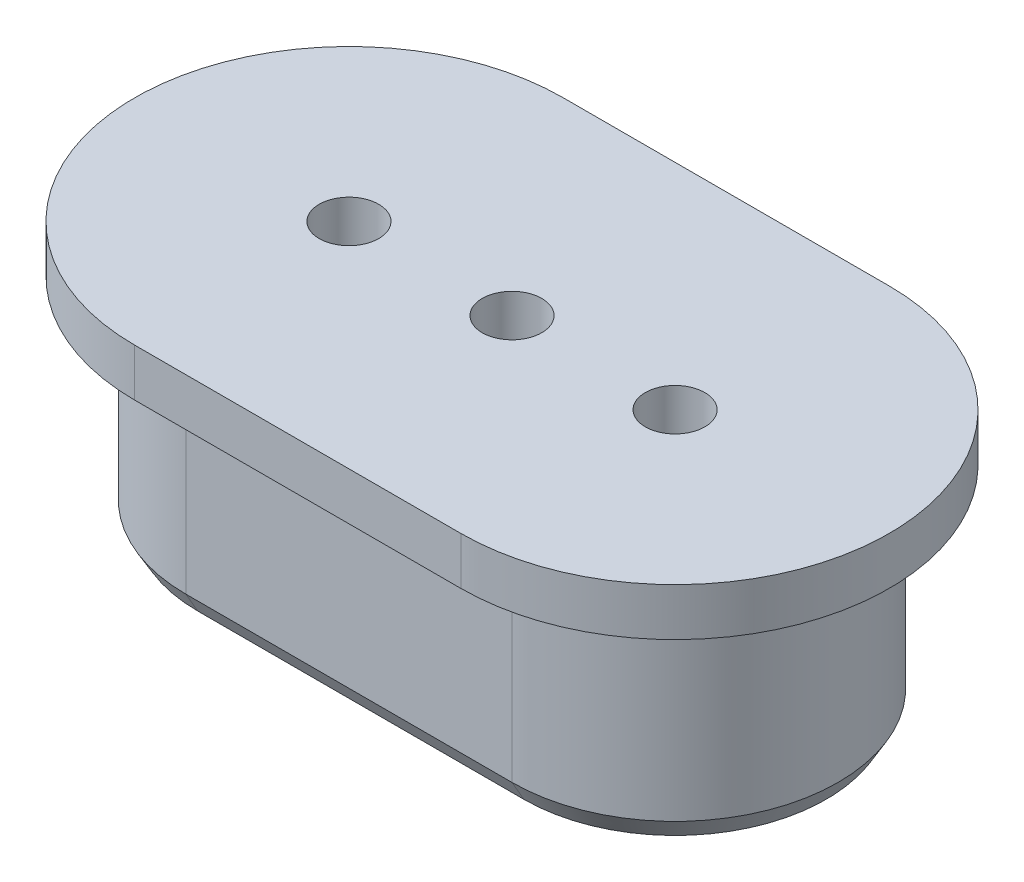
ISO-10303-21;
HEADER;
FILE_DESCRIPTION(('STEP AP214'),'2;1');
FILE_NAME('part.step','',(''),(''),'','','');
FILE_SCHEMA(('AUTOMOTIVE_DESIGN { 1 0 10303 214 1 1 1 1 }'));
ENDSEC;
DATA;
#1=APPLICATION_CONTEXT('core data for automotive mechanical design processes');
#2=APPLICATION_PROTOCOL_DEFINITION('international standard','automotive_design',2000,#1);
#3=PRODUCT_CONTEXT('',#1,'mechanical');
#4=PRODUCT('Part','Part','',(#3));
#5=PRODUCT_RELATED_PRODUCT_CATEGORY('part','',(#4));
#6=PRODUCT_DEFINITION_FORMATION('','',#4);
#7=PRODUCT_DEFINITION_CONTEXT('part definition',#1,'design');
#8=PRODUCT_DEFINITION('design','',#6,#7);
#9=PRODUCT_DEFINITION_SHAPE('','',#8);
#10=(LENGTH_UNIT() NAMED_UNIT(*) SI_UNIT(.MILLI.,.METRE.));
#11=(NAMED_UNIT(*) PLANE_ANGLE_UNIT() SI_UNIT($,.RADIAN.));
#12=(NAMED_UNIT(*) SI_UNIT($,.STERADIAN.) SOLID_ANGLE_UNIT());
#13=UNCERTAINTY_MEASURE_WITH_UNIT(LENGTH_MEASURE(1.E-05),#10,'distance_accuracy_value','');
#14=(GEOMETRIC_REPRESENTATION_CONTEXT(3) GLOBAL_UNCERTAINTY_ASSIGNED_CONTEXT((#13)) GLOBAL_UNIT_ASSIGNED_CONTEXT((#10,
#11,#12)) REPRESENTATION_CONTEXT('',''));
#15=CARTESIAN_POINT('',(0.,0.,0.));
#16=DIRECTION('',(0.,0.,1.));
#17=DIRECTION('',(1.,0.,0.));
#18=AXIS2_PLACEMENT_3D('',#15,#16,#17);
#19=CARTESIAN_POINT('',(3.425,0.,0.));
#20=DIRECTION('',(0.,-1.,0.));
#21=DIRECTION('',(0.,0.,-1.));
#22=AXIS2_PLACEMENT_3D('',#19,#20,#21);
#23=PLANE('',#22);
#24=DIRECTION('',(-1.,0.,0.));
#25=VECTOR('',#24,1.);
#26=CARTESIAN_POINT('',(-3.425,0.,3.175));
#27=LINE('',#26,#25);
#28=CARTESIAN_POINT('',(3.425,0.,3.175));
#29=VERTEX_POINT('',#28);
#30=CARTESIAN_POINT('',(-3.425,0.,3.175));
#31=VERTEX_POINT('',#30);
#32=EDGE_CURVE('E235',#29,#31,#27,.T.);
#33=ORIENTED_EDGE('',*,*,#32,.T.);
#34=CARTESIAN_POINT('',(-3.425,0.,0.));
#35=DIRECTION('',(0.,-1.,0.));
#36=DIRECTION('',(0.,0.,-1.));
#37=AXIS2_PLACEMENT_3D('',#34,#35,#36);
#38=CIRCLE('',#37,3.175);
#39=CARTESIAN_POINT('',(-3.425,0.,-3.175));
#40=VERTEX_POINT('',#39);
#41=EDGE_CURVE('E237',#31,#40,#38,.T.);
#42=ORIENTED_EDGE('',*,*,#41,.T.);
#43=DIRECTION('',(1.,0.,0.));
#44=VECTOR('',#43,1.);
#45=CARTESIAN_POINT('',(3.425,0.,-3.175));
#46=LINE('',#45,#44);
#47=CARTESIAN_POINT('',(3.425,0.,-3.175));
#48=VERTEX_POINT('',#47);
#49=EDGE_CURVE('E231',#40,#48,#46,.T.);
#50=ORIENTED_EDGE('',*,*,#49,.T.);
#51=CARTESIAN_POINT('',(3.425,0.,0.));
#52=DIRECTION('',(0.,-1.,0.));
#53=DIRECTION('',(0.,0.,-1.));
#54=AXIS2_PLACEMENT_3D('',#51,#52,#53);
#55=CIRCLE('',#54,3.175);
#56=EDGE_CURVE('E233',#48,#29,#55,.T.);
#57=ORIENTED_EDGE('',*,*,#56,.T.);
#58=EDGE_LOOP('',(#33,#42,#50,#57));
#59=FACE_BOUND('',#58,.T.);
#60=DIRECTION('',(1.,0.,0.));
#61=VECTOR('',#60,1.);
#62=CARTESIAN_POINT('',(-3.425,0.,2.925));
#63=LINE('',#62,#61);
#64=CARTESIAN_POINT('',(-3.425,0.,2.925));
#65=VERTEX_POINT('',#64);
#66=CARTESIAN_POINT('',(3.425,0.,2.925));
#67=VERTEX_POINT('',#66);
#68=EDGE_CURVE('E181',#65,#67,#63,.T.);
#69=ORIENTED_EDGE('',*,*,#68,.T.);
#70=CARTESIAN_POINT('',(3.425,0.,0.));
#71=DIRECTION('',(0.,1.,0.));
#72=DIRECTION('',(0.,0.,-1.));
#73=AXIS2_PLACEMENT_3D('',#70,#71,#72);
#74=CIRCLE('',#73,2.925);
#75=CARTESIAN_POINT('',(3.425,0.,-2.925));
#76=VERTEX_POINT('',#75);
#77=EDGE_CURVE('E168',#67,#76,#74,.T.);
#78=ORIENTED_EDGE('',*,*,#77,.T.);
#79=DIRECTION('',(-1.,0.,0.));
#80=VECTOR('',#79,1.);
#81=CARTESIAN_POINT('',(-3.425,0.,-2.925));
#82=LINE('',#81,#80);
#83=CARTESIAN_POINT('',(-3.425,0.,-2.925));
#84=VERTEX_POINT('',#83);
#85=EDGE_CURVE('E171',#76,#84,#82,.T.);
#86=ORIENTED_EDGE('',*,*,#85,.T.);
#87=CARTESIAN_POINT('',(-3.425,0.,0.));
#88=DIRECTION('',(0.,1.,0.));
#89=DIRECTION('',(0.,0.,1.));
#90=AXIS2_PLACEMENT_3D('',#87,#88,#89);
#91=CIRCLE('',#90,2.925);
#92=EDGE_CURVE('E193',#84,#65,#91,.T.);
#93=ORIENTED_EDGE('',*,*,#92,.T.);
#94=EDGE_LOOP('',(#69,#78,#86,#93));
#95=FACE_BOUND('',#94,.T.);
#96=ADVANCED_FACE('F37',(#59,#95),#23,.T.);
#97=CARTESIAN_POINT('',(3.425,4.5,0.));
#98=DIRECTION('',(0.,-1.,0.));
#99=DIRECTION('',(0.,0.,-1.));
#100=AXIS2_PLACEMENT_3D('',#97,#98,#99);
#101=CYLINDRICAL_SURFACE('',#100,3.425);
#102=DIRECTION('',(0.,-1.,0.));
#103=VECTOR('',#102,1.);
#104=CARTESIAN_POINT('',(3.425,4.5,3.425));
#105=LINE('',#104,#103);
#106=CARTESIAN_POINT('',(3.425,4.5,3.425));
#107=VERTEX_POINT('',#106);
#108=CARTESIAN_POINT('',(3.425,0.433012701892218,3.425));
#109=VERTEX_POINT('',#108);
#110=EDGE_CURVE('E219',#107,#109,#105,.T.);
#111=ORIENTED_EDGE('',*,*,#110,.T.);
#112=CARTESIAN_POINT('',(3.425,0.433012701892218,0.));
#113=DIRECTION('',(0.,-1.,0.));
#114=DIRECTION('',(0.,0.,-1.));
#115=AXIS2_PLACEMENT_3D('',#112,#113,#114);
#116=CIRCLE('',#115,3.425);
#117=CARTESIAN_POINT('',(3.425,0.433012701892218,-3.425));
#118=VERTEX_POINT('',#117);
#119=EDGE_CURVE('E47',#109,#118,#116,.F.);
#120=ORIENTED_EDGE('',*,*,#119,.T.);
#121=DIRECTION('',(0.,-1.,0.));
#122=VECTOR('',#121,1.);
#123=CARTESIAN_POINT('',(3.425,4.5,-3.425));
#124=LINE('',#123,#122);
#125=CARTESIAN_POINT('',(3.425,4.5,-3.425));
#126=VERTEX_POINT('',#125);
#127=EDGE_CURVE('E226',#126,#118,#124,.T.);
#128=ORIENTED_EDGE('',*,*,#127,.F.);
#129=CARTESIAN_POINT('',(3.425,4.5,0.));
#130=DIRECTION('',(0.,1.,0.));
#131=DIRECTION('',(0.,0.,-1.));
#132=AXIS2_PLACEMENT_3D('',#129,#130,#131);
#133=CIRCLE('',#132,3.425);
#134=EDGE_CURVE('E207',#107,#126,#133,.T.);
#135=ORIENTED_EDGE('',*,*,#134,.F.);
#136=EDGE_LOOP('',(#111,#120,#128,#135));
#137=FACE_BOUND('',#136,.T.);
#138=ADVANCED_FACE('F301',(#137),#101,.T.);
#139=CARTESIAN_POINT('',(-3.425,4.5,-3.425));
#140=DIRECTION('',(0.,0.,1.));
#141=DIRECTION('',(1.,0.,0.));
#142=AXIS2_PLACEMENT_3D('',#139,#140,#141);
#143=PLANE('',#142);
#144=ORIENTED_EDGE('',*,*,#127,.T.);
#145=DIRECTION('',(-1.,0.,0.));
#146=VECTOR('',#145,1.);
#147=CARTESIAN_POINT('',(-3.425,0.433012701892218,-3.425));
#148=LINE('',#147,#146);
#149=CARTESIAN_POINT('',(-3.425,0.433012701892218,-3.425));
#150=VERTEX_POINT('',#149);
#151=EDGE_CURVE('E11',#118,#150,#148,.T.);
#152=ORIENTED_EDGE('',*,*,#151,.T.);
#153=DIRECTION('',(0.,-1.,0.));
#154=VECTOR('',#153,1.);
#155=CARTESIAN_POINT('',(-3.425,4.5,-3.425));
#156=LINE('',#155,#154);
#157=CARTESIAN_POINT('',(-3.425,4.5,-3.425));
#158=VERTEX_POINT('',#157);
#159=EDGE_CURVE('E223',#158,#150,#156,.T.);
#160=ORIENTED_EDGE('',*,*,#159,.F.);
#161=DIRECTION('',(-1.,0.,0.));
#162=VECTOR('',#161,1.);
#163=CARTESIAN_POINT('',(-3.425,4.5,-3.425));
#164=LINE('',#163,#162);
#165=EDGE_CURVE('E210',#126,#158,#164,.T.);
#166=ORIENTED_EDGE('',*,*,#165,.F.);
#167=EDGE_LOOP('',(#144,#152,#160,#166));
#168=FACE_BOUND('',#167,.T.);
#169=ADVANCED_FACE('F307',(#168),#143,.F.);
#170=CARTESIAN_POINT('',(-3.425,4.5,0.));
#171=DIRECTION('',(0.,-1.,0.));
#172=DIRECTION('',(0.,0.,-1.));
#173=AXIS2_PLACEMENT_3D('',#170,#171,#172);
#174=CYLINDRICAL_SURFACE('',#173,3.425);
#175=ORIENTED_EDGE('',*,*,#159,.T.);
#176=CARTESIAN_POINT('',(-3.425,0.433012701892218,0.));
#177=DIRECTION('',(0.,-1.,0.));
#178=DIRECTION('',(0.,0.,-1.));
#179=AXIS2_PLACEMENT_3D('',#176,#177,#178);
#180=CIRCLE('',#179,3.425);
#181=CARTESIAN_POINT('',(-3.425,0.433012701892218,3.425));
#182=VERTEX_POINT('',#181);
#183=EDGE_CURVE('E228',#150,#182,#180,.F.);
#184=ORIENTED_EDGE('',*,*,#183,.T.);
#185=DIRECTION('',(0.,-1.,0.));
#186=VECTOR('',#185,1.);
#187=CARTESIAN_POINT('',(-3.425,4.5,3.425));
#188=LINE('',#187,#186);
#189=CARTESIAN_POINT('',(-3.425,4.5,3.425));
#190=VERTEX_POINT('',#189);
#191=EDGE_CURVE('E221',#190,#182,#188,.T.);
#192=ORIENTED_EDGE('',*,*,#191,.F.);
#193=CARTESIAN_POINT('',(-3.425,4.5,0.));
#194=DIRECTION('',(0.,1.,0.));
#195=DIRECTION('',(0.,0.,1.));
#196=AXIS2_PLACEMENT_3D('',#193,#194,#195);
#197=CIRCLE('',#196,3.425);
#198=EDGE_CURVE('E213',#158,#190,#197,.T.);
#199=ORIENTED_EDGE('',*,*,#198,.F.);
#200=EDGE_LOOP('',(#175,#184,#192,#199));
#201=FACE_BOUND('',#200,.T.);
#202=ADVANCED_FACE('F317',(#201),#174,.T.);
#203=CARTESIAN_POINT('',(-3.425,4.5,3.425));
#204=DIRECTION('',(0.,0.,-1.));
#205=DIRECTION('',(-1.,0.,0.));
#206=AXIS2_PLACEMENT_3D('',#203,#204,#205);
#207=PLANE('',#206);
#208=ORIENTED_EDGE('',*,*,#191,.T.);
#209=DIRECTION('',(1.,0.,0.));
#210=VECTOR('',#209,1.);
#211=CARTESIAN_POINT('',(3.425,0.433012701892218,3.425));
#212=LINE('',#211,#210);
#213=EDGE_CURVE('E62',#182,#109,#212,.T.);
#214=ORIENTED_EDGE('',*,*,#213,.T.);
#215=ORIENTED_EDGE('',*,*,#110,.F.);
#216=DIRECTION('',(1.,0.,0.));
#217=VECTOR('',#216,1.);
#218=CARTESIAN_POINT('',(-3.425,4.5,3.425));
#219=LINE('',#218,#217);
#220=EDGE_CURVE('E216',#190,#107,#219,.T.);
#221=ORIENTED_EDGE('',*,*,#220,.F.);
#222=EDGE_LOOP('',(#208,#214,#215,#221));
#223=FACE_BOUND('',#222,.T.);
#224=ADVANCED_FACE('F314',(#223),#207,.F.);
#225=CARTESIAN_POINT('',(3.425,4.5,0.));
#226=DIRECTION('',(0.,-1.,0.));
#227=DIRECTION('',(0.,0.,-1.));
#228=AXIS2_PLACEMENT_3D('',#225,#226,#227);
#229=CYLINDRICAL_SURFACE('',#228,2.925);
#230=ORIENTED_EDGE('',*,*,#77,.F.);
#231=DIRECTION('',(0.,-1.,0.));
#232=VECTOR('',#231,1.);
#233=CARTESIAN_POINT('',(3.425,4.5,2.925));
#234=LINE('',#233,#232);
#235=CARTESIAN_POINT('',(3.425,4.5,2.925));
#236=VERTEX_POINT('',#235);
#237=EDGE_CURVE('E189',#236,#67,#234,.T.);
#238=ORIENTED_EDGE('',*,*,#237,.F.);
#239=CARTESIAN_POINT('',(3.425,4.5,0.));
#240=DIRECTION('',(0.,1.,0.));
#241=DIRECTION('',(0.,0.,-1.));
#242=AXIS2_PLACEMENT_3D('',#239,#240,#241);
#243=CIRCLE('',#242,2.925);
#244=CARTESIAN_POINT('',(3.425,4.5,-2.925));
#245=VERTEX_POINT('',#244);
#246=EDGE_CURVE('E177',#236,#245,#243,.T.);
#247=ORIENTED_EDGE('',*,*,#246,.T.);
#248=DIRECTION('',(0.,-1.,0.));
#249=VECTOR('',#248,1.);
#250=CARTESIAN_POINT('',(3.425,4.5,-2.925));
#251=LINE('',#250,#249);
#252=EDGE_CURVE('E204',#245,#76,#251,.T.);
#253=ORIENTED_EDGE('',*,*,#252,.T.);
#254=EDGE_LOOP('',(#230,#238,#247,#253));
#255=FACE_BOUND('',#254,.T.);
#256=ADVANCED_FACE('F312',(#255),#229,.F.);
#257=CARTESIAN_POINT('',(-3.425,4.5,-2.925));
#258=DIRECTION('',(0.,0.,1.));
#259=DIRECTION('',(1.,0.,0.));
#260=AXIS2_PLACEMENT_3D('',#257,#258,#259);
#261=PLANE('',#260);
#262=ORIENTED_EDGE('',*,*,#85,.F.);
#263=ORIENTED_EDGE('',*,*,#252,.F.);
#264=DIRECTION('',(-1.,0.,0.));
#265=VECTOR('',#264,1.);
#266=CARTESIAN_POINT('',(-3.425,4.5,-2.925));
#267=LINE('',#266,#265);
#268=CARTESIAN_POINT('',(-3.425,4.5,-2.925));
#269=VERTEX_POINT('',#268);
#270=EDGE_CURVE('E180',#245,#269,#267,.T.);
#271=ORIENTED_EDGE('',*,*,#270,.T.);
#272=DIRECTION('',(0.,-1.,0.));
#273=VECTOR('',#272,1.);
#274=CARTESIAN_POINT('',(-3.425,4.5,-2.925));
#275=LINE('',#274,#273);
#276=EDGE_CURVE('E202',#269,#84,#275,.T.);
#277=ORIENTED_EDGE('',*,*,#276,.T.);
#278=EDGE_LOOP('',(#262,#263,#271,#277));
#279=FACE_BOUND('',#278,.T.);
#280=ADVANCED_FACE('F502',(#279),#261,.T.);
#281=CARTESIAN_POINT('',(-3.425,4.5,0.));
#282=DIRECTION('',(0.,-1.,0.));
#283=DIRECTION('',(0.,0.,-1.));
#284=AXIS2_PLACEMENT_3D('',#281,#282,#283);
#285=CYLINDRICAL_SURFACE('',#284,2.925);
#286=ORIENTED_EDGE('',*,*,#92,.F.);
#287=ORIENTED_EDGE('',*,*,#276,.F.);
#288=CARTESIAN_POINT('',(-3.425,4.5,0.));
#289=DIRECTION('',(0.,1.,0.));
#290=DIRECTION('',(0.,0.,1.));
#291=AXIS2_PLACEMENT_3D('',#288,#289,#290);
#292=CIRCLE('',#291,2.925);
#293=CARTESIAN_POINT('',(-3.425,4.5,2.925));
#294=VERTEX_POINT('',#293);
#295=EDGE_CURVE('E184',#269,#294,#292,.T.);
#296=ORIENTED_EDGE('',*,*,#295,.T.);
#297=DIRECTION('',(0.,-1.,0.));
#298=VECTOR('',#297,1.);
#299=CARTESIAN_POINT('',(-3.425,4.5,2.925));
#300=LINE('',#299,#298);
#301=EDGE_CURVE('E200',#294,#65,#300,.T.);
#302=ORIENTED_EDGE('',*,*,#301,.T.);
#303=EDGE_LOOP('',(#286,#287,#296,#302));
#304=FACE_BOUND('',#303,.T.);
#305=ADVANCED_FACE('F372',(#304),#285,.F.);
#306=CARTESIAN_POINT('',(-3.425,4.5,2.925));
#307=DIRECTION('',(0.,0.,-1.));
#308=DIRECTION('',(-1.,0.,0.));
#309=AXIS2_PLACEMENT_3D('',#306,#307,#308);
#310=PLANE('',#309);
#311=ORIENTED_EDGE('',*,*,#68,.F.);
#312=ORIENTED_EDGE('',*,*,#301,.F.);
#313=DIRECTION('',(1.,0.,0.));
#314=VECTOR('',#313,1.);
#315=CARTESIAN_POINT('',(-3.425,4.5,2.925));
#316=LINE('',#315,#314);
#317=EDGE_CURVE('E187',#294,#236,#316,.T.);
#318=ORIENTED_EDGE('',*,*,#317,.T.);
#319=ORIENTED_EDGE('',*,*,#237,.T.);
#320=EDGE_LOOP('',(#311,#312,#318,#319));
#321=FACE_BOUND('',#320,.T.);
#322=ADVANCED_FACE('F363',(#321),#310,.T.);
#323=CARTESIAN_POINT('',(-3.425,4.5,0.));
#324=DIRECTION('',(0.,1.,0.));
#325=DIRECTION('',(0.,0.,1.));
#326=AXIS2_PLACEMENT_3D('',#323,#324,#325);
#327=PLANE('',#326);
#328=CARTESIAN_POINT('',(-3.425,4.5,0.));
#329=DIRECTION('',(0.,1.,0.));
#330=DIRECTION('',(0.,0.,1.));
#331=AXIS2_PLACEMENT_3D('',#328,#329,#330);
#332=CIRCLE('',#331,4.5);
#333=CARTESIAN_POINT('',(-3.425,4.5,-4.5));
#334=VERTEX_POINT('',#333);
#335=CARTESIAN_POINT('',(-3.425,4.5,4.5));
#336=VERTEX_POINT('',#335);
#337=EDGE_CURVE('E167',#334,#336,#332,.T.);
#338=ORIENTED_EDGE('',*,*,#337,.F.);
#339=DIRECTION('',(-1.,0.,0.));
#340=VECTOR('',#339,1.);
#341=CARTESIAN_POINT('',(-3.425,4.5,-4.5));
#342=LINE('',#341,#340);
#343=CARTESIAN_POINT('',(3.425,4.5,-4.5));
#344=VERTEX_POINT('',#343);
#345=EDGE_CURVE('E163',#344,#334,#342,.T.);
#346=ORIENTED_EDGE('',*,*,#345,.F.);
#347=CARTESIAN_POINT('',(3.425,4.5,0.));
#348=DIRECTION('',(0.,1.,0.));
#349=DIRECTION('',(0.,0.,-1.));
#350=AXIS2_PLACEMENT_3D('',#347,#348,#349);
#351=CIRCLE('',#350,4.5);
#352=CARTESIAN_POINT('',(3.425,4.5,4.5));
#353=VERTEX_POINT('',#352);
#354=EDGE_CURVE('E277',#353,#344,#351,.T.);
#355=ORIENTED_EDGE('',*,*,#354,.F.);
#356=DIRECTION('',(1.,0.,0.));
#357=VECTOR('',#356,1.);
#358=CARTESIAN_POINT('',(-3.425,4.5,4.5));
#359=LINE('',#358,#357);
#360=EDGE_CURVE('E275',#336,#353,#359,.T.);
#361=ORIENTED_EDGE('',*,*,#360,.F.);
#362=EDGE_LOOP('',(#338,#346,#355,#361));
#363=FACE_BOUND('',#362,.T.);
#364=ORIENTED_EDGE('',*,*,#220,.T.);
#365=ORIENTED_EDGE('',*,*,#134,.T.);
#366=ORIENTED_EDGE('',*,*,#165,.T.);
#367=ORIENTED_EDGE('',*,*,#198,.T.);
#368=EDGE_LOOP('',(#364,#365,#366,#367));
#369=FACE_BOUND('',#368,.T.);
#370=ADVANCED_FACE('F288',(#363,#369),#327,.F.);
#371=CARTESIAN_POINT('',(-3.425,5.5,0.));
#372=DIRECTION('',(0.,1.,0.));
#373=DIRECTION('',(0.,0.,1.));
#374=AXIS2_PLACEMENT_3D('',#371,#372,#373);
#375=PLANE('',#374);
#376=CARTESIAN_POINT('',(0.,5.5,0.));
#377=DIRECTION('',(0.,1.,0.));
#378=DIRECTION('',(0.,0.,1.));
#379=AXIS2_PLACEMENT_3D('',#376,#377,#378);
#380=CIRCLE('',#379,0.625);
#381=CARTESIAN_POINT('',(0.,5.5,0.625));
#382=VERTEX_POINT('',#381);
#383=EDGE_CURVE('E245',#382,#382,#380,.T.);
#384=ORIENTED_EDGE('',*,*,#383,.F.);
#385=EDGE_LOOP('',(#384));
#386=FACE_BOUND('',#385,.T.);
#387=CARTESIAN_POINT('',(-3.425,5.5,0.));
#388=DIRECTION('',(0.,1.,0.));
#389=DIRECTION('',(0.,0.,1.));
#390=AXIS2_PLACEMENT_3D('',#387,#388,#389);
#391=CIRCLE('',#390,0.625);
#392=CARTESIAN_POINT('',(-3.425,5.5,0.625));
#393=VERTEX_POINT('',#392);
#394=EDGE_CURVE('E266',#393,#393,#391,.T.);
#395=ORIENTED_EDGE('',*,*,#394,.F.);
#396=EDGE_LOOP('',(#395));
#397=FACE_BOUND('',#396,.T.);
#398=CARTESIAN_POINT('',(-3.425,5.5,0.));
#399=DIRECTION('',(0.,1.,0.));
#400=DIRECTION('',(0.,0.,1.));
#401=AXIS2_PLACEMENT_3D('',#398,#399,#400);
#402=CIRCLE('',#401,4.5);
#403=CARTESIAN_POINT('',(-3.425,5.5,-4.5));
#404=VERTEX_POINT('',#403);
#405=CARTESIAN_POINT('',(-3.425,5.5,4.5));
#406=VERTEX_POINT('',#405);
#407=EDGE_CURVE('E153',#404,#406,#402,.T.);
#408=ORIENTED_EDGE('',*,*,#407,.T.);
#409=DIRECTION('',(1.,0.,0.));
#410=VECTOR('',#409,1.);
#411=CARTESIAN_POINT('',(-3.425,5.5,4.5));
#412=LINE('',#411,#410);
#413=CARTESIAN_POINT('',(3.425,5.5,4.5));
#414=VERTEX_POINT('',#413);
#415=EDGE_CURVE('E142',#406,#414,#412,.T.);
#416=ORIENTED_EDGE('',*,*,#415,.T.);
#417=CARTESIAN_POINT('',(3.425,5.5,0.));
#418=DIRECTION('',(0.,1.,0.));
#419=DIRECTION('',(0.,0.,-1.));
#420=AXIS2_PLACEMENT_3D('',#417,#418,#419);
#421=CIRCLE('',#420,4.5);
#422=CARTESIAN_POINT('',(3.425,5.5,-4.5));
#423=VERTEX_POINT('',#422);
#424=EDGE_CURVE('E152',#414,#423,#421,.T.);
#425=ORIENTED_EDGE('',*,*,#424,.T.);
#426=DIRECTION('',(-1.,0.,0.));
#427=VECTOR('',#426,1.);
#428=CARTESIAN_POINT('',(-3.425,5.5,-4.5));
#429=LINE('',#428,#427);
#430=EDGE_CURVE('E159',#423,#404,#429,.T.);
#431=ORIENTED_EDGE('',*,*,#430,.T.);
#432=EDGE_LOOP('',(#408,#416,#425,#431));
#433=FACE_BOUND('',#432,.T.);
#434=CARTESIAN_POINT('',(3.425,5.5,0.));
#435=DIRECTION('',(0.,1.,0.));
#436=DIRECTION('',(0.,0.,1.));
#437=AXIS2_PLACEMENT_3D('',#434,#435,#436);
#438=CIRCLE('',#437,0.625);
#439=CARTESIAN_POINT('',(3.425,5.5,0.625));
#440=VERTEX_POINT('',#439);
#441=EDGE_CURVE('E257',#440,#440,#438,.T.);
#442=ORIENTED_EDGE('',*,*,#441,.F.);
#443=EDGE_LOOP('',(#442));
#444=FACE_BOUND('',#443,.T.);
#445=ADVANCED_FACE('F156',(#386,#397,#433,#444),#375,.T.);
#446=CARTESIAN_POINT('',(0.,4.5,0.));
#447=DIRECTION('',(0.,1.,0.));
#448=DIRECTION('',(0.,0.,1.));
#449=AXIS2_PLACEMENT_3D('',#446,#447,#448);
#450=CIRCLE('',#449,0.625);
#451=CARTESIAN_POINT('',(0.,4.5,0.625));
#452=VERTEX_POINT('',#451);
#453=EDGE_CURVE('E42',#452,#452,#450,.T.);
#454=ORIENTED_EDGE('',*,*,#453,.T.);
#455=EDGE_LOOP('',(#454));
#456=FACE_BOUND('',#455,.T.);
#457=ORIENTED_EDGE('',*,*,#246,.F.);
#458=ORIENTED_EDGE('',*,*,#317,.F.);
#459=ORIENTED_EDGE('',*,*,#295,.F.);
#460=ORIENTED_EDGE('',*,*,#270,.F.);
#461=EDGE_LOOP('',(#457,#458,#459,#460));
#462=FACE_BOUND('',#461,.T.);
#463=CARTESIAN_POINT('',(-3.425,4.5,0.));
#464=DIRECTION('',(0.,1.,0.));
#465=DIRECTION('',(0.,0.,1.));
#466=AXIS2_PLACEMENT_3D('',#463,#464,#465);
#467=CIRCLE('',#466,0.625);
#468=CARTESIAN_POINT('',(-3.425,4.5,0.625));
#469=VERTEX_POINT('',#468);
#470=EDGE_CURVE('E262',#469,#469,#467,.T.);
#471=ORIENTED_EDGE('',*,*,#470,.T.);
#472=EDGE_LOOP('',(#471));
#473=FACE_BOUND('',#472,.T.);
#474=CARTESIAN_POINT('',(3.425,4.5,0.));
#475=DIRECTION('',(0.,1.,0.));
#476=DIRECTION('',(0.,0.,1.));
#477=AXIS2_PLACEMENT_3D('',#474,#475,#476);
#478=CIRCLE('',#477,0.625);
#479=CARTESIAN_POINT('',(3.425,4.5,0.625));
#480=VERTEX_POINT('',#479);
#481=EDGE_CURVE('E251',#480,#480,#478,.T.);
#482=ORIENTED_EDGE('',*,*,#481,.T.);
#483=EDGE_LOOP('',(#482));
#484=FACE_BOUND('',#483,.T.);
#485=ADVANCED_FACE('F365',(#456,#462,#473,#484),#327,.F.);
#486=CARTESIAN_POINT('',(-3.425,5.5,0.));
#487=DIRECTION('',(0.,-1.,0.));
#488=DIRECTION('',(0.,0.,-1.));
#489=AXIS2_PLACEMENT_3D('',#486,#487,#488);
#490=CYLINDRICAL_SURFACE('',#489,4.5);
#491=ORIENTED_EDGE('',*,*,#337,.T.);
#492=DIRECTION('',(0.,-1.,0.));
#493=VECTOR('',#492,1.);
#494=CARTESIAN_POINT('',(-3.425,5.5,4.5));
#495=LINE('',#494,#493);
#496=EDGE_CURVE('E146',#406,#336,#495,.T.);
#497=ORIENTED_EDGE('',*,*,#496,.F.);
#498=ORIENTED_EDGE('',*,*,#407,.F.);
#499=DIRECTION('',(0.,-1.,0.));
#500=VECTOR('',#499,1.);
#501=CARTESIAN_POINT('',(-3.425,5.5,-4.5));
#502=LINE('',#501,#500);
#503=EDGE_CURVE('E273',#404,#334,#502,.T.);
#504=ORIENTED_EDGE('',*,*,#503,.T.);
#505=EDGE_LOOP('',(#491,#497,#498,#504));
#506=FACE_BOUND('',#505,.T.);
#507=ADVANCED_FACE('F165',(#506),#490,.T.);
#508=CARTESIAN_POINT('',(-3.425,5.5,4.5));
#509=DIRECTION('',(0.,0.,-1.));
#510=DIRECTION('',(-1.,0.,0.));
#511=AXIS2_PLACEMENT_3D('',#508,#509,#510);
#512=PLANE('',#511);
#513=ORIENTED_EDGE('',*,*,#360,.T.);
#514=DIRECTION('',(0.,-1.,0.));
#515=VECTOR('',#514,1.);
#516=CARTESIAN_POINT('',(3.425,5.5,4.5));
#517=LINE('',#516,#515);
#518=EDGE_CURVE('E149',#414,#353,#517,.T.);
#519=ORIENTED_EDGE('',*,*,#518,.F.);
#520=ORIENTED_EDGE('',*,*,#415,.F.);
#521=ORIENTED_EDGE('',*,*,#496,.T.);
#522=EDGE_LOOP('',(#513,#519,#520,#521));
#523=FACE_BOUND('',#522,.T.);
#524=ADVANCED_FACE('F144',(#523),#512,.F.);
#525=CARTESIAN_POINT('',(3.425,5.5,0.));
#526=DIRECTION('',(0.,-1.,0.));
#527=DIRECTION('',(0.,0.,-1.));
#528=AXIS2_PLACEMENT_3D('',#525,#526,#527);
#529=CYLINDRICAL_SURFACE('',#528,4.5);
#530=ORIENTED_EDGE('',*,*,#354,.T.);
#531=DIRECTION('',(0.,-1.,0.));
#532=VECTOR('',#531,1.);
#533=CARTESIAN_POINT('',(3.425,5.5,-4.5));
#534=LINE('',#533,#532);
#535=EDGE_CURVE('E173',#423,#344,#534,.T.);
#536=ORIENTED_EDGE('',*,*,#535,.F.);
#537=ORIENTED_EDGE('',*,*,#424,.F.);
#538=ORIENTED_EDGE('',*,*,#518,.T.);
#539=EDGE_LOOP('',(#530,#536,#537,#538));
#540=FACE_BOUND('',#539,.T.);
#541=ADVANCED_FACE('F290',(#540),#529,.T.);
#542=CARTESIAN_POINT('',(-3.425,5.5,-4.5));
#543=DIRECTION('',(0.,0.,1.));
#544=DIRECTION('',(1.,0.,0.));
#545=AXIS2_PLACEMENT_3D('',#542,#543,#544);
#546=PLANE('',#545);
#547=ORIENTED_EDGE('',*,*,#345,.T.);
#548=ORIENTED_EDGE('',*,*,#503,.F.);
#549=ORIENTED_EDGE('',*,*,#430,.F.);
#550=ORIENTED_EDGE('',*,*,#535,.T.);
#551=EDGE_LOOP('',(#547,#548,#549,#550));
#552=FACE_BOUND('',#551,.T.);
#553=ADVANCED_FACE('F284',(#552),#546,.F.);
#554=CARTESIAN_POINT('',(-3.425,5.5,0.));
#555=DIRECTION('',(0.,-1.,0.));
#556=DIRECTION('',(0.,0.,-1.));
#557=AXIS2_PLACEMENT_3D('',#554,#555,#556);
#558=CYLINDRICAL_SURFACE('',#557,0.625);
#559=ORIENTED_EDGE('',*,*,#394,.T.);
#560=EDGE_LOOP('',(#559));
#561=FACE_BOUND('',#560,.T.);
#562=ORIENTED_EDGE('',*,*,#470,.F.);
#563=EDGE_LOOP('',(#562));
#564=FACE_BOUND('',#563,.T.);
#565=ADVANCED_FACE('F297',(#561,#564),#558,.F.);
#566=CARTESIAN_POINT('',(3.425,5.5,0.));
#567=DIRECTION('',(0.,-1.,0.));
#568=DIRECTION('',(0.,0.,-1.));
#569=AXIS2_PLACEMENT_3D('',#566,#567,#568);
#570=CYLINDRICAL_SURFACE('',#569,0.625);
#571=ORIENTED_EDGE('',*,*,#441,.T.);
#572=EDGE_LOOP('',(#571));
#573=FACE_BOUND('',#572,.T.);
#574=ORIENTED_EDGE('',*,*,#481,.F.);
#575=EDGE_LOOP('',(#574));
#576=FACE_BOUND('',#575,.T.);
#577=ADVANCED_FACE('F346',(#573,#576),#570,.F.);
#578=CARTESIAN_POINT('',(3.425,0.433012701892218,0.));
#579=DIRECTION('',(0.,1.,0.));
#580=DIRECTION('',(0.,0.,1.));
#581=AXIS2_PLACEMENT_3D('',#578,#579,#580);
#582=CONICAL_SURFACE('',#581,3.425,0.523598775598301);
#583=DIRECTION('',(0.,0.866025403784438,0.500000000000002));
#584=VECTOR('',#583,1.);
#585=CARTESIAN_POINT('',(3.425,0.,3.175));
#586=LINE('',#585,#584);
#587=EDGE_CURVE('E247',#29,#109,#586,.T.);
#588=ORIENTED_EDGE('',*,*,#587,.F.);
#589=ORIENTED_EDGE('',*,*,#56,.F.);
#590=DIRECTION('',(0.,-0.866025403784438,0.500000000000002));
#591=VECTOR('',#590,1.);
#592=CARTESIAN_POINT('',(3.425,0.433012701892218,-3.425));
#593=LINE('',#592,#591);
#594=EDGE_CURVE('E249',#118,#48,#593,.T.);
#595=ORIENTED_EDGE('',*,*,#594,.F.);
#596=ORIENTED_EDGE('',*,*,#119,.F.);
#597=EDGE_LOOP('',(#588,#589,#595,#596));
#598=FACE_BOUND('',#597,.T.);
#599=ADVANCED_FACE('F40',(#598),#582,.T.);
#600=CARTESIAN_POINT('',(-3.425,0.433012701892218,-3.425));
#601=DIRECTION('',(0.,-0.500000000000002,-0.866025403784438));
#602=DIRECTION('',(1.,0.,0.));
#603=AXIS2_PLACEMENT_3D('',#600,#601,#602);
#604=PLANE('',#603);
#605=ORIENTED_EDGE('',*,*,#594,.T.);
#606=ORIENTED_EDGE('',*,*,#49,.F.);
#607=DIRECTION('',(0.,-0.866025403784438,0.500000000000002));
#608=VECTOR('',#607,1.);
#609=CARTESIAN_POINT('',(-3.425,0.433012701892218,-3.425));
#610=LINE('',#609,#608);
#611=EDGE_CURVE('E244',#150,#40,#610,.T.);
#612=ORIENTED_EDGE('',*,*,#611,.F.);
#613=ORIENTED_EDGE('',*,*,#151,.F.);
#614=EDGE_LOOP('',(#605,#606,#612,#613));
#615=FACE_BOUND('',#614,.T.);
#616=ADVANCED_FACE('F338',(#615),#604,.T.);
#617=CARTESIAN_POINT('',(-3.425,0.433012701892218,3.425));
#618=DIRECTION('',(0.,-0.500000000000002,0.866025403784438));
#619=DIRECTION('',(-1.,0.,0.));
#620=AXIS2_PLACEMENT_3D('',#617,#618,#619);
#621=PLANE('',#620);
#622=ORIENTED_EDGE('',*,*,#587,.T.);
#623=ORIENTED_EDGE('',*,*,#213,.F.);
#624=DIRECTION('',(0.,0.866025403784438,0.500000000000002));
#625=VECTOR('',#624,1.);
#626=CARTESIAN_POINT('',(-3.425,0.,3.175));
#627=LINE('',#626,#625);
#628=EDGE_CURVE('E242',#31,#182,#627,.T.);
#629=ORIENTED_EDGE('',*,*,#628,.F.);
#630=ORIENTED_EDGE('',*,*,#32,.F.);
#631=EDGE_LOOP('',(#622,#623,#629,#630));
#632=FACE_BOUND('',#631,.T.);
#633=ADVANCED_FACE('F332',(#632),#621,.T.);
#634=CARTESIAN_POINT('',(-3.425,0.433012701892218,0.));
#635=DIRECTION('',(0.,1.,0.));
#636=DIRECTION('',(0.,0.,1.));
#637=AXIS2_PLACEMENT_3D('',#634,#635,#636);
#638=CONICAL_SURFACE('',#637,3.425,0.523598775598301);
#639=ORIENTED_EDGE('',*,*,#611,.T.);
#640=ORIENTED_EDGE('',*,*,#41,.F.);
#641=ORIENTED_EDGE('',*,*,#628,.T.);
#642=ORIENTED_EDGE('',*,*,#183,.F.);
#643=EDGE_LOOP('',(#639,#640,#641,#642));
#644=FACE_BOUND('',#643,.T.);
#645=ADVANCED_FACE('F325',(#644),#638,.T.);
#646=CARTESIAN_POINT('',(0.,0.,0.));
#647=DIRECTION('',(0.,1.,0.));
#648=DIRECTION('',(0.,0.,1.));
#649=AXIS2_PLACEMENT_3D('',#646,#647,#648);
#650=CYLINDRICAL_SURFACE('',#649,0.625);
#651=ORIENTED_EDGE('',*,*,#383,.T.);
#652=EDGE_LOOP('',(#651));
#653=FACE_BOUND('',#652,.T.);
#654=ORIENTED_EDGE('',*,*,#453,.F.);
#655=EDGE_LOOP('',(#654));
#656=FACE_BOUND('',#655,.T.);
#657=ADVANCED_FACE('F331',(#653,#656),#650,.F.);
#658=CLOSED_SHELL('',(#96,#138,#169,#202,#224,#256,#280,#305,#322,#370,#445,#485,#507,#524,#541,
#553,#565,#577,#599,#616,#633,#645,#657));
#659=MANIFOLD_SOLID_BREP('B2',#658);
#660=ADVANCED_BREP_SHAPE_REPRESENTATION('',(#18,#659),#14);
#661=SHAPE_DEFINITION_REPRESENTATION(#9,#660);
ENDSEC;
END-ISO-10303-21;
